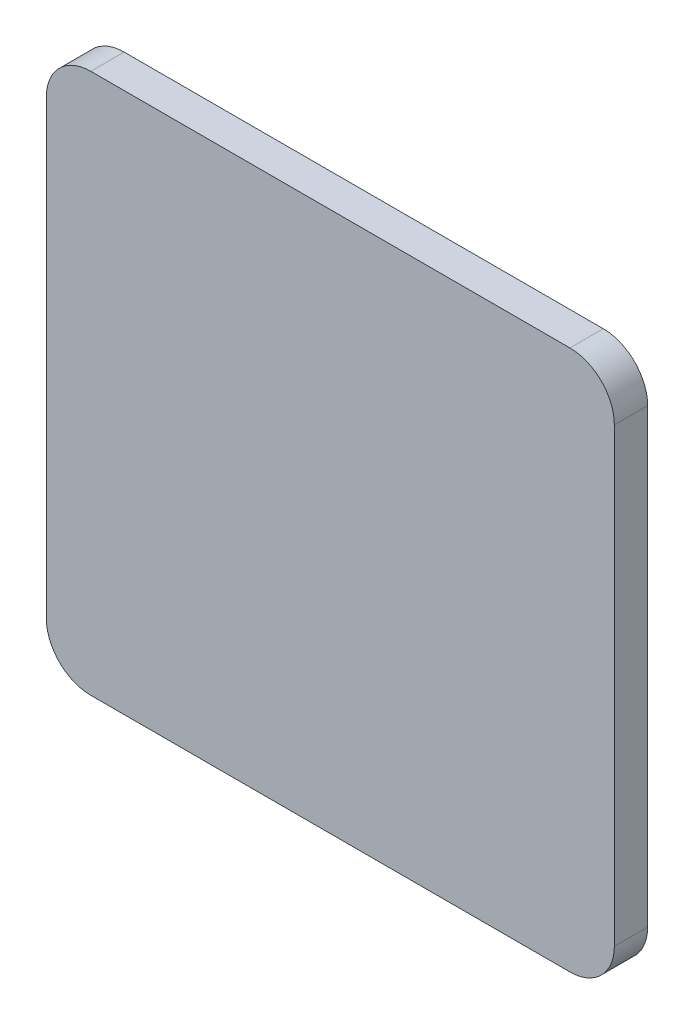
ISO-10303-21;
HEADER;
FILE_DESCRIPTION(('STEP AP214'),'2;1');
FILE_NAME('part.step','',(''),(''),'','','');
FILE_SCHEMA(('AUTOMOTIVE_DESIGN { 1 0 10303 214 1 1 1 1 }'));
ENDSEC;
DATA;
#1=APPLICATION_CONTEXT('core data for automotive mechanical design processes');
#2=APPLICATION_PROTOCOL_DEFINITION('international standard','automotive_design',2000,#1);
#3=PRODUCT_CONTEXT('',#1,'mechanical');
#4=PRODUCT('Part','Part','',(#3));
#5=PRODUCT_RELATED_PRODUCT_CATEGORY('part','',(#4));
#6=PRODUCT_DEFINITION_FORMATION('','',#4);
#7=PRODUCT_DEFINITION_CONTEXT('part definition',#1,'design');
#8=PRODUCT_DEFINITION('design','',#6,#7);
#9=PRODUCT_DEFINITION_SHAPE('','',#8);
#10=(LENGTH_UNIT() NAMED_UNIT(*) SI_UNIT(.MILLI.,.METRE.));
#11=(NAMED_UNIT(*) PLANE_ANGLE_UNIT() SI_UNIT($,.RADIAN.));
#12=(NAMED_UNIT(*) SI_UNIT($,.STERADIAN.) SOLID_ANGLE_UNIT());
#13=UNCERTAINTY_MEASURE_WITH_UNIT(LENGTH_MEASURE(1.E-05),#10,'distance_accuracy_value','');
#14=(GEOMETRIC_REPRESENTATION_CONTEXT(3) GLOBAL_UNCERTAINTY_ASSIGNED_CONTEXT((#13)) GLOBAL_UNIT_ASSIGNED_CONTEXT((#10,
#11,#12)) REPRESENTATION_CONTEXT('',''));
#15=CARTESIAN_POINT('',(0.,0.,0.));
#16=DIRECTION('',(0.,0.,1.));
#17=DIRECTION('',(1.,0.,0.));
#18=AXIS2_PLACEMENT_3D('',#15,#16,#17);
#19=CARTESIAN_POINT('',(0.,0.,1.5));
#20=DIRECTION('',(1.,0.,0.));
#21=DIRECTION('',(0.,0.,-1.));
#22=AXIS2_PLACEMENT_3D('',#19,#20,#21);
#23=PLANE('',#22);
#24=DIRECTION('',(0.,-1.,0.));
#25=VECTOR('',#24,1.);
#26=CARTESIAN_POINT('',(0.,0.,0.));
#27=LINE('',#26,#25);
#28=CARTESIAN_POINT('',(0.,22.3319157924697,0.));
#29=VERTEX_POINT('',#28);
#30=CARTESIAN_POINT('',(0.,2.,0.));
#31=VERTEX_POINT('',#30);
#32=EDGE_CURVE('E131',#29,#31,#27,.T.);
#33=ORIENTED_EDGE('',*,*,#32,.T.);
#34=DIRECTION('',(0.,0.,-1.));
#35=VECTOR('',#34,1.);
#36=CARTESIAN_POINT('',(0.,2.,1.5));
#37=LINE('',#36,#35);
#38=CARTESIAN_POINT('',(0.,2.,1.5));
#39=VERTEX_POINT('',#38);
#40=EDGE_CURVE('E11',#31,#39,#37,.F.);
#41=ORIENTED_EDGE('',*,*,#40,.T.);
#42=DIRECTION('',(0.,-1.,0.));
#43=VECTOR('',#42,1.);
#44=CARTESIAN_POINT('',(0.,0.,1.5));
#45=LINE('',#44,#43);
#46=CARTESIAN_POINT('',(0.,22.3319157924697,1.5));
#47=VERTEX_POINT('',#46);
#48=EDGE_CURVE('E129',#47,#39,#45,.T.);
#49=ORIENTED_EDGE('',*,*,#48,.F.);
#50=DIRECTION('',(0.,0.,-1.));
#51=VECTOR('',#50,1.);
#52=CARTESIAN_POINT('',(0.,22.3319157924697,1.5));
#53=LINE('',#52,#51);
#54=EDGE_CURVE('E43',#47,#29,#53,.T.);
#55=ORIENTED_EDGE('',*,*,#54,.T.);
#56=EDGE_LOOP('',(#33,#41,#49,#55));
#57=FACE_BOUND('',#56,.T.);
#58=ADVANCED_FACE('F35',(#57),#23,.F.);
#59=CARTESIAN_POINT('',(0.,0.,1.5));
#60=DIRECTION('',(0.,1.,0.));
#61=DIRECTION('',(0.,0.,1.));
#62=AXIS2_PLACEMENT_3D('',#59,#60,#61);
#63=PLANE('',#62);
#64=DIRECTION('',(1.,0.,0.));
#65=VECTOR('',#64,1.);
#66=CARTESIAN_POINT('',(0.,0.,0.));
#67=LINE('',#66,#65);
#68=CARTESIAN_POINT('',(2.,0.,0.));
#69=VERTEX_POINT('',#68);
#70=CARTESIAN_POINT('',(23.5749975436822,0.,0.));
#71=VERTEX_POINT('',#70);
#72=EDGE_CURVE('E127',#69,#71,#67,.T.);
#73=ORIENTED_EDGE('',*,*,#72,.T.);
#74=DIRECTION('',(0.,0.,-1.));
#75=VECTOR('',#74,1.);
#76=CARTESIAN_POINT('',(23.5749975436822,0.,1.5));
#77=LINE('',#76,#75);
#78=CARTESIAN_POINT('',(23.5749975436822,0.,1.5));
#79=VERTEX_POINT('',#78);
#80=EDGE_CURVE('E106',#71,#79,#77,.F.);
#81=ORIENTED_EDGE('',*,*,#80,.T.);
#82=DIRECTION('',(1.,0.,0.));
#83=VECTOR('',#82,1.);
#84=CARTESIAN_POINT('',(0.,0.,1.5));
#85=LINE('',#84,#83);
#86=CARTESIAN_POINT('',(2.,0.,1.5));
#87=VERTEX_POINT('',#86);
#88=EDGE_CURVE('E167',#87,#79,#85,.T.);
#89=ORIENTED_EDGE('',*,*,#88,.F.);
#90=DIRECTION('',(0.,0.,-1.));
#91=VECTOR('',#90,1.);
#92=CARTESIAN_POINT('',(2.,0.,1.5));
#93=LINE('',#92,#91);
#94=EDGE_CURVE('E111',#87,#69,#93,.T.);
#95=ORIENTED_EDGE('',*,*,#94,.T.);
#96=EDGE_LOOP('',(#73,#81,#89,#95));
#97=FACE_BOUND('',#96,.T.);
#98=ADVANCED_FACE('F177',(#97),#63,.F.);
#99=CARTESIAN_POINT('',(25.5749975436822,0.,1.5));
#100=DIRECTION('',(-1.,0.,0.));
#101=DIRECTION('',(0.,-1.,0.));
#102=AXIS2_PLACEMENT_3D('',#99,#100,#101);
#103=PLANE('',#102);
#104=DIRECTION('',(0.,1.,0.));
#105=VECTOR('',#104,1.);
#106=CARTESIAN_POINT('',(25.5749975436822,0.,1.5));
#107=LINE('',#106,#105);
#108=CARTESIAN_POINT('',(25.5749975436822,2.,1.5));
#109=VERTEX_POINT('',#108);
#110=CARTESIAN_POINT('',(25.5749975436823,22.3319157924697,1.5));
#111=VERTEX_POINT('',#110);
#112=EDGE_CURVE('E120',#109,#111,#107,.T.);
#113=ORIENTED_EDGE('',*,*,#112,.F.);
#114=DIRECTION('',(0.,0.,-1.));
#115=VECTOR('',#114,1.);
#116=CARTESIAN_POINT('',(25.5749975436822,2.,1.5));
#117=LINE('',#116,#115);
#118=CARTESIAN_POINT('',(25.5749975436822,2.,0.));
#119=VERTEX_POINT('',#118);
#120=EDGE_CURVE('E105',#109,#119,#117,.T.);
#121=ORIENTED_EDGE('',*,*,#120,.T.);
#122=DIRECTION('',(0.,1.,0.));
#123=VECTOR('',#122,1.);
#124=CARTESIAN_POINT('',(25.5749975436822,0.,0.));
#125=LINE('',#124,#123);
#126=CARTESIAN_POINT('',(25.5749975436823,22.3319157924697,0.));
#127=VERTEX_POINT('',#126);
#128=EDGE_CURVE('E118',#119,#127,#125,.T.);
#129=ORIENTED_EDGE('',*,*,#128,.T.);
#130=DIRECTION('',(0.,0.,-1.));
#131=VECTOR('',#130,1.);
#132=CARTESIAN_POINT('',(25.5749975436823,22.3319157924697,1.5));
#133=LINE('',#132,#131);
#134=EDGE_CURVE('E122',#127,#111,#133,.F.);
#135=ORIENTED_EDGE('',*,*,#134,.T.);
#136=EDGE_LOOP('',(#113,#121,#129,#135));
#137=FACE_BOUND('',#136,.T.);
#138=ADVANCED_FACE('F117',(#137),#103,.F.);
#139=CARTESIAN_POINT('',(0.,24.3319157924697,1.5));
#140=DIRECTION('',(0.,-1.,0.));
#141=DIRECTION('',(0.,0.,-1.));
#142=AXIS2_PLACEMENT_3D('',#139,#140,#141);
#143=PLANE('',#142);
#144=DIRECTION('',(-1.,0.,0.));
#145=VECTOR('',#144,1.);
#146=CARTESIAN_POINT('',(0.,24.3319157924697,1.5));
#147=LINE('',#146,#145);
#148=CARTESIAN_POINT('',(23.5749975436822,24.3319157924697,1.5));
#149=VERTEX_POINT('',#148);
#150=CARTESIAN_POINT('',(2.,24.3319157924697,1.5));
#151=VERTEX_POINT('',#150);
#152=EDGE_CURVE('E135',#149,#151,#147,.T.);
#153=ORIENTED_EDGE('',*,*,#152,.F.);
#154=DIRECTION('',(0.,0.,-1.));
#155=VECTOR('',#154,1.);
#156=CARTESIAN_POINT('',(23.5749975436822,24.3319157924697,1.5));
#157=LINE('',#156,#155);
#158=CARTESIAN_POINT('',(23.5749975436822,24.3319157924697,0.));
#159=VERTEX_POINT('',#158);
#160=EDGE_CURVE('E152',#149,#159,#157,.T.);
#161=ORIENTED_EDGE('',*,*,#160,.T.);
#162=DIRECTION('',(-1.,0.,0.));
#163=VECTOR('',#162,1.);
#164=CARTESIAN_POINT('',(0.,24.3319157924697,0.));
#165=LINE('',#164,#163);
#166=CARTESIAN_POINT('',(2.,24.3319157924697,0.));
#167=VERTEX_POINT('',#166);
#168=EDGE_CURVE('E126',#159,#167,#165,.T.);
#169=ORIENTED_EDGE('',*,*,#168,.T.);
#170=DIRECTION('',(0.,0.,-1.));
#171=VECTOR('',#170,1.);
#172=CARTESIAN_POINT('',(2.,24.3319157924697,1.5));
#173=LINE('',#172,#171);
#174=EDGE_CURVE('E50',#167,#151,#173,.F.);
#175=ORIENTED_EDGE('',*,*,#174,.T.);
#176=EDGE_LOOP('',(#153,#161,#169,#175));
#177=FACE_BOUND('',#176,.T.);
#178=ADVANCED_FACE('F181',(#177),#143,.F.);
#179=CARTESIAN_POINT('',(0.,0.,1.5));
#180=DIRECTION('',(0.,0.,-1.));
#181=DIRECTION('',(-1.,0.,0.));
#182=AXIS2_PLACEMENT_3D('',#179,#180,#181);
#183=PLANE('',#182);
#184=ORIENTED_EDGE('',*,*,#88,.T.);
#185=CARTESIAN_POINT('',(23.5749975436822,2.,1.5));
#186=DIRECTION('',(0.,0.,-1.));
#187=DIRECTION('',(-1.,0.,0.));
#188=AXIS2_PLACEMENT_3D('',#185,#186,#187);
#189=CIRCLE('',#188,2.);
#190=EDGE_CURVE('E149',#79,#109,#189,.F.);
#191=ORIENTED_EDGE('',*,*,#190,.T.);
#192=ORIENTED_EDGE('',*,*,#112,.T.);
#193=CARTESIAN_POINT('',(23.5749975436822,22.3319157924697,1.5));
#194=DIRECTION('',(0.,0.,-1.));
#195=DIRECTION('',(-1.,0.,0.));
#196=AXIS2_PLACEMENT_3D('',#193,#194,#195);
#197=CIRCLE('',#196,2.);
#198=EDGE_CURVE('E57',#111,#149,#197,.F.);
#199=ORIENTED_EDGE('',*,*,#198,.T.);
#200=ORIENTED_EDGE('',*,*,#152,.T.);
#201=CARTESIAN_POINT('',(2.,22.3319157924697,1.5));
#202=DIRECTION('',(0.,0.,-1.));
#203=DIRECTION('',(-1.,0.,0.));
#204=AXIS2_PLACEMENT_3D('',#201,#202,#203);
#205=CIRCLE('',#204,2.);
#206=EDGE_CURVE('E144',#151,#47,#205,.F.);
#207=ORIENTED_EDGE('',*,*,#206,.T.);
#208=ORIENTED_EDGE('',*,*,#48,.T.);
#209=CARTESIAN_POINT('',(2.,2.,1.5));
#210=DIRECTION('',(0.,0.,-1.));
#211=DIRECTION('',(-1.,0.,0.));
#212=AXIS2_PLACEMENT_3D('',#209,#210,#211);
#213=CIRCLE('',#212,2.);
#214=EDGE_CURVE('E146',#39,#87,#213,.F.);
#215=ORIENTED_EDGE('',*,*,#214,.T.);
#216=EDGE_LOOP('',(#184,#191,#192,#199,#200,#207,#208,#215));
#217=FACE_BOUND('',#216,.T.);
#218=ADVANCED_FACE('F171',(#217),#183,.F.);
#219=CARTESIAN_POINT('',(0.,0.,0.));
#220=DIRECTION('',(0.,0.,-1.));
#221=DIRECTION('',(-1.,0.,0.));
#222=AXIS2_PLACEMENT_3D('',#219,#220,#221);
#223=PLANE('',#222);
#224=ORIENTED_EDGE('',*,*,#128,.F.);
#225=CARTESIAN_POINT('',(23.5749975436822,2.,0.));
#226=DIRECTION('',(0.,0.,-1.));
#227=DIRECTION('',(-1.,0.,0.));
#228=AXIS2_PLACEMENT_3D('',#225,#226,#227);
#229=CIRCLE('',#228,2.);
#230=EDGE_CURVE('E101',#119,#71,#229,.T.);
#231=ORIENTED_EDGE('',*,*,#230,.T.);
#232=ORIENTED_EDGE('',*,*,#72,.F.);
#233=CARTESIAN_POINT('',(2.,2.,0.));
#234=DIRECTION('',(0.,0.,-1.));
#235=DIRECTION('',(-1.,0.,0.));
#236=AXIS2_PLACEMENT_3D('',#233,#234,#235);
#237=CIRCLE('',#236,2.);
#238=EDGE_CURVE('E138',#69,#31,#237,.T.);
#239=ORIENTED_EDGE('',*,*,#238,.T.);
#240=ORIENTED_EDGE('',*,*,#32,.F.);
#241=CARTESIAN_POINT('',(2.,22.3319157924697,0.));
#242=DIRECTION('',(0.,0.,-1.));
#243=DIRECTION('',(-1.,0.,0.));
#244=AXIS2_PLACEMENT_3D('',#241,#242,#243);
#245=CIRCLE('',#244,2.);
#246=EDGE_CURVE('E121',#29,#167,#245,.T.);
#247=ORIENTED_EDGE('',*,*,#246,.T.);
#248=ORIENTED_EDGE('',*,*,#168,.F.);
#249=CARTESIAN_POINT('',(23.5749975436822,22.3319157924697,0.));
#250=DIRECTION('',(0.,0.,-1.));
#251=DIRECTION('',(-1.,0.,0.));
#252=AXIS2_PLACEMENT_3D('',#249,#250,#251);
#253=CIRCLE('',#252,2.);
#254=EDGE_CURVE('E112',#159,#127,#253,.T.);
#255=ORIENTED_EDGE('',*,*,#254,.T.);
#256=EDGE_LOOP('',(#224,#231,#232,#239,#240,#247,#248,#255));
#257=FACE_BOUND('',#256,.T.);
#258=ADVANCED_FACE('F124',(#257),#223,.T.);
#259=CARTESIAN_POINT('',(23.5749975436822,2.,1.5));
#260=DIRECTION('',(0.,0.,-1.));
#261=DIRECTION('',(-1.,0.,0.));
#262=AXIS2_PLACEMENT_3D('',#259,#260,#261);
#263=CYLINDRICAL_SURFACE('',#262,2.);
#264=ORIENTED_EDGE('',*,*,#190,.F.);
#265=ORIENTED_EDGE('',*,*,#80,.F.);
#266=ORIENTED_EDGE('',*,*,#230,.F.);
#267=ORIENTED_EDGE('',*,*,#120,.F.);
#268=EDGE_LOOP('',(#264,#265,#266,#267));
#269=FACE_BOUND('',#268,.T.);
#270=ADVANCED_FACE('F104',(#269),#263,.T.);
#271=CARTESIAN_POINT('',(23.5749975436822,22.3319157924697,1.5));
#272=DIRECTION('',(0.,0.,-1.));
#273=DIRECTION('',(-1.,0.,0.));
#274=AXIS2_PLACEMENT_3D('',#271,#272,#273);
#275=CYLINDRICAL_SURFACE('',#274,2.);
#276=ORIENTED_EDGE('',*,*,#198,.F.);
#277=ORIENTED_EDGE('',*,*,#134,.F.);
#278=ORIENTED_EDGE('',*,*,#254,.F.);
#279=ORIENTED_EDGE('',*,*,#160,.F.);
#280=EDGE_LOOP('',(#276,#277,#278,#279));
#281=FACE_BOUND('',#280,.T.);
#282=ADVANCED_FACE('F180',(#281),#275,.T.);
#283=CARTESIAN_POINT('',(2.,2.,1.5));
#284=DIRECTION('',(0.,0.,-1.));
#285=DIRECTION('',(-1.,0.,0.));
#286=AXIS2_PLACEMENT_3D('',#283,#284,#285);
#287=CYLINDRICAL_SURFACE('',#286,2.);
#288=ORIENTED_EDGE('',*,*,#214,.F.);
#289=ORIENTED_EDGE('',*,*,#40,.F.);
#290=ORIENTED_EDGE('',*,*,#238,.F.);
#291=ORIENTED_EDGE('',*,*,#94,.F.);
#292=EDGE_LOOP('',(#288,#289,#290,#291));
#293=FACE_BOUND('',#292,.T.);
#294=ADVANCED_FACE('F175',(#293),#287,.T.);
#295=CARTESIAN_POINT('',(2.,22.3319157924697,1.5));
#296=DIRECTION('',(0.,0.,-1.));
#297=DIRECTION('',(-1.,0.,0.));
#298=AXIS2_PLACEMENT_3D('',#295,#296,#297);
#299=CYLINDRICAL_SURFACE('',#298,2.);
#300=ORIENTED_EDGE('',*,*,#206,.F.);
#301=ORIENTED_EDGE('',*,*,#174,.F.);
#302=ORIENTED_EDGE('',*,*,#246,.F.);
#303=ORIENTED_EDGE('',*,*,#54,.F.);
#304=EDGE_LOOP('',(#300,#301,#302,#303));
#305=FACE_BOUND('',#304,.T.);
#306=ADVANCED_FACE('F37',(#305),#299,.T.);
#307=CLOSED_SHELL('',(#58,#98,#138,#178,#218,#258,#270,#282,#294,#306));
#308=MANIFOLD_SOLID_BREP('B2',#307);
#309=ADVANCED_BREP_SHAPE_REPRESENTATION('',(#18,#308),#14);
#310=SHAPE_DEFINITION_REPRESENTATION(#9,#309);
ENDSEC;
END-ISO-10303-21;
